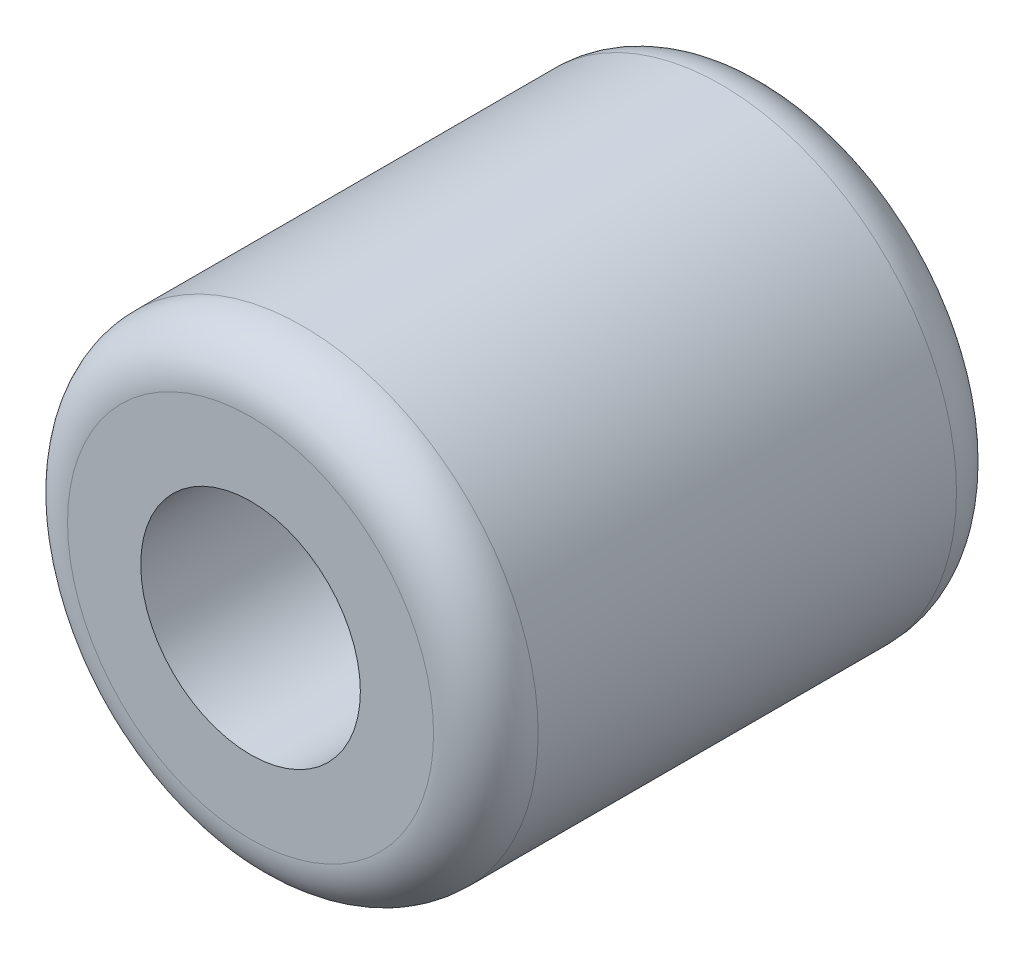
ISO-10303-21;
HEADER;
FILE_DESCRIPTION(('STEP AP214'),'2;1');
FILE_NAME('part.step','',(''),(''),'','','');
FILE_SCHEMA(('AUTOMOTIVE_DESIGN { 1 0 10303 214 1 1 1 1 }'));
ENDSEC;
DATA;
#1=APPLICATION_CONTEXT('core data for automotive mechanical design processes');
#2=APPLICATION_PROTOCOL_DEFINITION('international standard','automotive_design',2000,#1);
#3=PRODUCT_CONTEXT('',#1,'mechanical');
#4=PRODUCT('Part','Part','',(#3));
#5=PRODUCT_RELATED_PRODUCT_CATEGORY('part','',(#4));
#6=PRODUCT_DEFINITION_FORMATION('','',#4);
#7=PRODUCT_DEFINITION_CONTEXT('part definition',#1,'design');
#8=PRODUCT_DEFINITION('design','',#6,#7);
#9=PRODUCT_DEFINITION_SHAPE('','',#8);
#10=(LENGTH_UNIT() NAMED_UNIT(*) SI_UNIT(.MILLI.,.METRE.));
#11=(NAMED_UNIT(*) PLANE_ANGLE_UNIT() SI_UNIT($,.RADIAN.));
#12=(NAMED_UNIT(*) SI_UNIT($,.STERADIAN.) SOLID_ANGLE_UNIT());
#13=UNCERTAINTY_MEASURE_WITH_UNIT(LENGTH_MEASURE(1.E-05),#10,'distance_accuracy_value','');
#14=(GEOMETRIC_REPRESENTATION_CONTEXT(3) GLOBAL_UNCERTAINTY_ASSIGNED_CONTEXT((#13)) GLOBAL_UNIT_ASSIGNED_CONTEXT((#10,
#11,#12)) REPRESENTATION_CONTEXT('',''));
#15=CARTESIAN_POINT('',(0.,0.,0.));
#16=DIRECTION('',(0.,0.,1.));
#17=DIRECTION('',(1.,0.,0.));
#18=AXIS2_PLACEMENT_3D('',#15,#16,#17);
#19=CARTESIAN_POINT('',(0.,0.,10.));
#20=DIRECTION('',(0.,0.,1.));
#21=DIRECTION('',(1.,0.,0.));
#22=AXIS2_PLACEMENT_3D('',#19,#20,#21);
#23=PLANE('',#22);
#24=CARTESIAN_POINT('',(0.,0.,10.));
#25=DIRECTION('',(0.,0.,1.));
#26=DIRECTION('',(1.,0.,0.));
#27=AXIS2_PLACEMENT_3D('',#24,#25,#26);
#28=CIRCLE('',#27,3.5);
#29=CARTESIAN_POINT('',(3.5,0.,10.));
#30=VERTEX_POINT('',#29);
#31=EDGE_CURVE('E12',#30,#30,#28,.T.);
#32=ORIENTED_EDGE('',*,*,#31,.T.);
#33=EDGE_LOOP('',(#32));
#34=FACE_BOUND('',#33,.T.);
#35=CARTESIAN_POINT('',(0.,0.,10.));
#36=DIRECTION('',(0.,0.,1.));
#37=DIRECTION('',(1.,0.,0.));
#38=AXIS2_PLACEMENT_3D('',#35,#36,#37);
#39=CIRCLE('',#38,2.1);
#40=CARTESIAN_POINT('',(2.1,0.,10.));
#41=VERTEX_POINT('',#40);
#42=EDGE_CURVE('E65',#41,#41,#39,.T.);
#43=ORIENTED_EDGE('',*,*,#42,.F.);
#44=EDGE_LOOP('',(#43));
#45=FACE_BOUND('',#44,.T.);
#46=ADVANCED_FACE('F45',(#34,#45),#23,.T.);
#47=CARTESIAN_POINT('',(0.,0.,0.));
#48=DIRECTION('',(0.,0.,1.));
#49=DIRECTION('',(1.,0.,0.));
#50=AXIS2_PLACEMENT_3D('',#47,#48,#49);
#51=PLANE('',#50);
#52=CARTESIAN_POINT('',(0.,0.,0.));
#53=DIRECTION('',(0.,0.,1.));
#54=DIRECTION('',(1.,0.,0.));
#55=AXIS2_PLACEMENT_3D('',#52,#53,#54);
#56=CIRCLE('',#55,3.5);
#57=CARTESIAN_POINT('',(3.5,0.,0.));
#58=VERTEX_POINT('',#57);
#59=EDGE_CURVE('E52',#58,#58,#56,.F.);
#60=ORIENTED_EDGE('',*,*,#59,.T.);
#61=EDGE_LOOP('',(#60));
#62=FACE_BOUND('',#61,.T.);
#63=CARTESIAN_POINT('',(0.,0.,0.));
#64=DIRECTION('',(0.,0.,1.));
#65=DIRECTION('',(1.,0.,0.));
#66=AXIS2_PLACEMENT_3D('',#63,#64,#65);
#67=CIRCLE('',#66,2.1);
#68=CARTESIAN_POINT('',(2.1,0.,0.));
#69=VERTEX_POINT('',#68);
#70=EDGE_CURVE('E66',#69,#69,#67,.T.);
#71=ORIENTED_EDGE('',*,*,#70,.T.);
#72=EDGE_LOOP('',(#71));
#73=FACE_BOUND('',#72,.T.);
#74=ADVANCED_FACE('F76',(#62,#73),#51,.F.);
#75=CARTESIAN_POINT('',(0.,0.,10.));
#76=DIRECTION('',(0.,0.,-1.));
#77=DIRECTION('',(-1.,0.,0.));
#78=AXIS2_PLACEMENT_3D('',#75,#76,#77);
#79=CYLINDRICAL_SURFACE('',#78,4.5);
#80=CARTESIAN_POINT('',(0.,0.,0.999999999999999));
#81=DIRECTION('',(0.,0.,1.));
#82=DIRECTION('',(1.,0.,0.));
#83=AXIS2_PLACEMENT_3D('',#80,#81,#82);
#84=CIRCLE('',#83,4.5);
#85=CARTESIAN_POINT('',(4.5,0.,0.999999999999999));
#86=VERTEX_POINT('',#85);
#87=EDGE_CURVE('E56',#86,#86,#84,.T.);
#88=ORIENTED_EDGE('',*,*,#87,.T.);
#89=EDGE_LOOP('',(#88));
#90=FACE_BOUND('',#89,.T.);
#91=CARTESIAN_POINT('',(0.,0.,9.));
#92=DIRECTION('',(0.,0.,1.));
#93=DIRECTION('',(1.,0.,0.));
#94=AXIS2_PLACEMENT_3D('',#91,#92,#93);
#95=CIRCLE('',#94,4.5);
#96=CARTESIAN_POINT('',(4.5,0.,9.));
#97=VERTEX_POINT('',#96);
#98=EDGE_CURVE('E60',#97,#97,#95,.F.);
#99=ORIENTED_EDGE('',*,*,#98,.T.);
#100=EDGE_LOOP('',(#99));
#101=FACE_BOUND('',#100,.T.);
#102=ADVANCED_FACE('F81',(#90,#101),#79,.T.);
#103=CARTESIAN_POINT('',(0.,0.,10.));
#104=DIRECTION('',(0.,0.,-1.));
#105=DIRECTION('',(-1.,0.,0.));
#106=AXIS2_PLACEMENT_3D('',#103,#104,#105);
#107=CYLINDRICAL_SURFACE('',#106,2.1);
#108=ORIENTED_EDGE('',*,*,#42,.T.);
#109=EDGE_LOOP('',(#108));
#110=FACE_BOUND('',#109,.T.);
#111=ORIENTED_EDGE('',*,*,#70,.F.);
#112=EDGE_LOOP('',(#111));
#113=FACE_BOUND('',#112,.T.);
#114=ADVANCED_FACE('F72',(#110,#113),#107,.F.);
#115=CARTESIAN_POINT('',(0.,0.,0.999999999999999));
#116=DIRECTION('',(0.,0.,1.));
#117=DIRECTION('',(1.,0.,0.));
#118=AXIS2_PLACEMENT_3D('',#115,#116,#117);
#119=TOROIDAL_SURFACE('',#118,3.5,1.);
#120=ORIENTED_EDGE('',*,*,#59,.F.);
#121=EDGE_LOOP('',(#120));
#122=FACE_BOUND('',#121,.T.);
#123=ORIENTED_EDGE('',*,*,#87,.F.);
#124=EDGE_LOOP('',(#123));
#125=FACE_BOUND('',#124,.T.);
#126=ADVANCED_FACE('F87',(#122,#125),#119,.T.);
#127=CARTESIAN_POINT('',(0.,0.,9.));
#128=DIRECTION('',(0.,0.,1.));
#129=DIRECTION('',(1.,0.,0.));
#130=AXIS2_PLACEMENT_3D('',#127,#128,#129);
#131=TOROIDAL_SURFACE('',#130,3.5,1.);
#132=ORIENTED_EDGE('',*,*,#98,.F.);
#133=EDGE_LOOP('',(#132));
#134=FACE_BOUND('',#133,.T.);
#135=ORIENTED_EDGE('',*,*,#31,.F.);
#136=EDGE_LOOP('',(#135));
#137=FACE_BOUND('',#136,.T.);
#138=ADVANCED_FACE('F47',(#134,#137),#131,.T.);
#139=CLOSED_SHELL('',(#46,#74,#102,#114,#126,#138));
#140=MANIFOLD_SOLID_BREP('B2',#139);
#141=ADVANCED_BREP_SHAPE_REPRESENTATION('',(#18,#140),#14);
#142=SHAPE_DEFINITION_REPRESENTATION(#9,#141);
ENDSEC;
END-ISO-10303-21;
